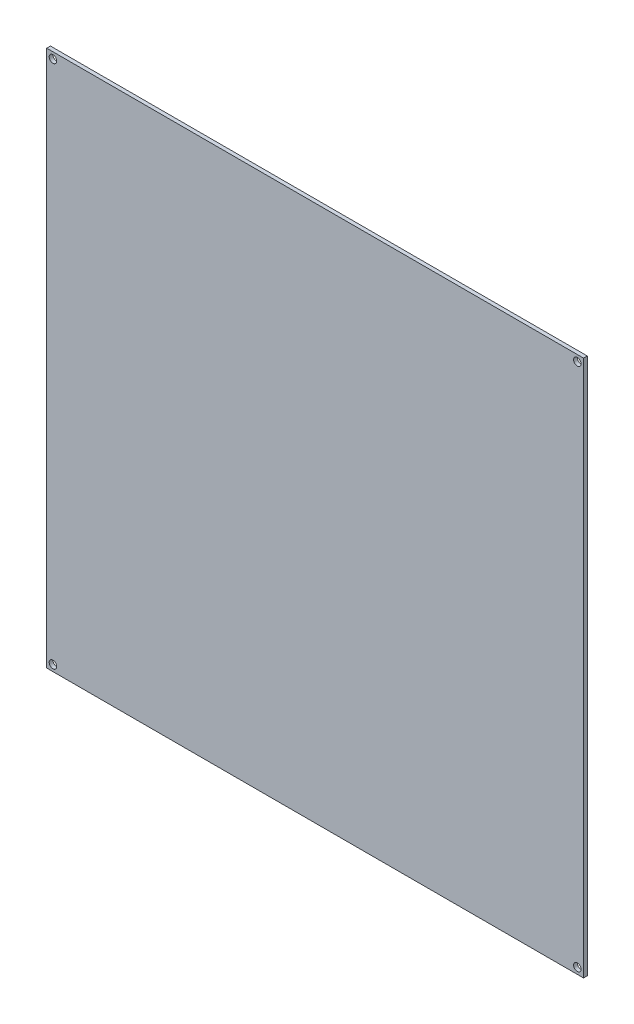
ISO-10303-21;
HEADER;
FILE_DESCRIPTION(('STEP AP214'),'2;1');
FILE_NAME('part.step','',(''),(''),'','','');
FILE_SCHEMA(('AUTOMOTIVE_DESIGN { 1 0 10303 214 1 1 1 1 }'));
ENDSEC;
DATA;
#1=APPLICATION_CONTEXT('core data for automotive mechanical design processes');
#2=APPLICATION_PROTOCOL_DEFINITION('international standard','automotive_design',2000,#1);
#3=PRODUCT_CONTEXT('',#1,'mechanical');
#4=PRODUCT('Part','Part','',(#3));
#5=PRODUCT_RELATED_PRODUCT_CATEGORY('part','',(#4));
#6=PRODUCT_DEFINITION_FORMATION('','',#4);
#7=PRODUCT_DEFINITION_CONTEXT('part definition',#1,'design');
#8=PRODUCT_DEFINITION('design','',#6,#7);
#9=PRODUCT_DEFINITION_SHAPE('','',#8);
#10=(LENGTH_UNIT() NAMED_UNIT(*) SI_UNIT(.MILLI.,.METRE.));
#11=(NAMED_UNIT(*) PLANE_ANGLE_UNIT() SI_UNIT($,.RADIAN.));
#12=(NAMED_UNIT(*) SI_UNIT($,.STERADIAN.) SOLID_ANGLE_UNIT());
#13=UNCERTAINTY_MEASURE_WITH_UNIT(LENGTH_MEASURE(1.E-05),#10,'distance_accuracy_value','');
#14=(GEOMETRIC_REPRESENTATION_CONTEXT(3) GLOBAL_UNCERTAINTY_ASSIGNED_CONTEXT((#13)) GLOBAL_UNIT_ASSIGNED_CONTEXT((#10,
#11,#12)) REPRESENTATION_CONTEXT('',''));
#15=CARTESIAN_POINT('',(0.,0.,0.));
#16=DIRECTION('',(0.,0.,1.));
#17=DIRECTION('',(1.,0.,0.));
#18=AXIS2_PLACEMENT_3D('',#15,#16,#17);
#19=CARTESIAN_POINT('',(0.,0.,1.5));
#20=DIRECTION('',(0.,0.,1.));
#21=DIRECTION('',(1.,0.,0.));
#22=AXIS2_PLACEMENT_3D('',#19,#20,#21);
#23=PLANE('',#22);
#24=CARTESIAN_POINT('',(105.,-105.,1.5));
#25=DIRECTION('',(0.,0.,1.));
#26=DIRECTION('',(1.,0.,0.));
#27=AXIS2_PLACEMENT_3D('',#24,#25,#26);
#28=CIRCLE('',#27,1.5);
#29=CARTESIAN_POINT('',(106.5,-105.,1.5));
#30=VERTEX_POINT('',#29);
#31=EDGE_CURVE('E121',#30,#30,#28,.T.);
#32=ORIENTED_EDGE('',*,*,#31,.F.);
#33=EDGE_LOOP('',(#32));
#34=FACE_BOUND('',#33,.T.);
#35=CARTESIAN_POINT('',(-105.,105.,1.5));
#36=DIRECTION('',(0.,0.,1.));
#37=DIRECTION('',(1.,0.,0.));
#38=AXIS2_PLACEMENT_3D('',#35,#36,#37);
#39=CIRCLE('',#38,1.5);
#40=CARTESIAN_POINT('',(-103.5,105.,1.5));
#41=VERTEX_POINT('',#40);
#42=EDGE_CURVE('E100',#41,#41,#39,.T.);
#43=ORIENTED_EDGE('',*,*,#42,.F.);
#44=EDGE_LOOP('',(#43));
#45=FACE_BOUND('',#44,.T.);
#46=DIRECTION('',(0.,1.,0.));
#47=VECTOR('',#46,1.);
#48=CARTESIAN_POINT('',(107.5,107.5,1.5));
#49=LINE('',#48,#47);
#50=CARTESIAN_POINT('',(107.5,-107.5,1.5));
#51=VERTEX_POINT('',#50);
#52=CARTESIAN_POINT('',(107.5,107.5,1.5));
#53=VERTEX_POINT('',#52);
#54=EDGE_CURVE('E85',#51,#53,#49,.T.);
#55=ORIENTED_EDGE('',*,*,#54,.T.);
#56=DIRECTION('',(-1.,0.,0.));
#57=VECTOR('',#56,1.);
#58=CARTESIAN_POINT('',(-107.5,107.5,1.5));
#59=LINE('',#58,#57);
#60=CARTESIAN_POINT('',(-107.5,107.5,1.5));
#61=VERTEX_POINT('',#60);
#62=EDGE_CURVE('E80',#53,#61,#59,.T.);
#63=ORIENTED_EDGE('',*,*,#62,.T.);
#64=DIRECTION('',(0.,-1.,0.));
#65=VECTOR('',#64,1.);
#66=CARTESIAN_POINT('',(-107.5,107.5,1.5));
#67=LINE('',#66,#65);
#68=CARTESIAN_POINT('',(-107.5,-107.5,1.5));
#69=VERTEX_POINT('',#68);
#70=EDGE_CURVE('E83',#61,#69,#67,.T.);
#71=ORIENTED_EDGE('',*,*,#70,.T.);
#72=DIRECTION('',(1.,0.,0.));
#73=VECTOR('',#72,1.);
#74=CARTESIAN_POINT('',(-107.5,-107.5,1.5));
#75=LINE('',#74,#73);
#76=EDGE_CURVE('E50',#69,#51,#75,.T.);
#77=ORIENTED_EDGE('',*,*,#76,.T.);
#78=EDGE_LOOP('',(#55,#63,#71,#77));
#79=FACE_BOUND('',#78,.T.);
#80=CARTESIAN_POINT('',(105.,105.,1.5));
#81=DIRECTION('',(0.,0.,1.));
#82=DIRECTION('',(1.,0.,0.));
#83=AXIS2_PLACEMENT_3D('',#80,#81,#82);
#84=CIRCLE('',#83,1.5);
#85=CARTESIAN_POINT('',(106.5,105.,1.5));
#86=VERTEX_POINT('',#85);
#87=EDGE_CURVE('E115',#86,#86,#84,.T.);
#88=ORIENTED_EDGE('',*,*,#87,.F.);
#89=EDGE_LOOP('',(#88));
#90=FACE_BOUND('',#89,.T.);
#91=CARTESIAN_POINT('',(-105.,-105.,1.5));
#92=DIRECTION('',(0.,0.,1.));
#93=DIRECTION('',(1.,0.,0.));
#94=AXIS2_PLACEMENT_3D('',#91,#92,#93);
#95=CIRCLE('',#94,1.5);
#96=CARTESIAN_POINT('',(-103.5,-105.,1.5));
#97=VERTEX_POINT('',#96);
#98=EDGE_CURVE('E127',#97,#97,#95,.T.);
#99=ORIENTED_EDGE('',*,*,#98,.F.);
#100=EDGE_LOOP('',(#99));
#101=FACE_BOUND('',#100,.T.);
#102=ADVANCED_FACE('F33',(#34,#45,#79,#90,#101),#23,.T.);
#103=CARTESIAN_POINT('',(0.,0.,0.));
#104=DIRECTION('',(0.,0.,1.));
#105=DIRECTION('',(1.,0.,0.));
#106=AXIS2_PLACEMENT_3D('',#103,#104,#105);
#107=PLANE('',#106);
#108=DIRECTION('',(0.,1.,0.));
#109=VECTOR('',#108,1.);
#110=CARTESIAN_POINT('',(107.5,107.5,0.));
#111=LINE('',#110,#109);
#112=CARTESIAN_POINT('',(107.5,-107.5,0.));
#113=VERTEX_POINT('',#112);
#114=CARTESIAN_POINT('',(107.5,107.5,0.));
#115=VERTEX_POINT('',#114);
#116=EDGE_CURVE('E97',#113,#115,#111,.T.);
#117=ORIENTED_EDGE('',*,*,#116,.F.);
#118=DIRECTION('',(1.,0.,0.));
#119=VECTOR('',#118,1.);
#120=CARTESIAN_POINT('',(-107.5,-107.5,0.));
#121=LINE('',#120,#119);
#122=CARTESIAN_POINT('',(-107.5,-107.5,0.));
#123=VERTEX_POINT('',#122);
#124=EDGE_CURVE('E73',#123,#113,#121,.T.);
#125=ORIENTED_EDGE('',*,*,#124,.F.);
#126=DIRECTION('',(0.,-1.,0.));
#127=VECTOR('',#126,1.);
#128=CARTESIAN_POINT('',(-107.5,107.5,0.));
#129=LINE('',#128,#127);
#130=CARTESIAN_POINT('',(-107.5,107.5,0.));
#131=VERTEX_POINT('',#130);
#132=EDGE_CURVE('E67',#131,#123,#129,.T.);
#133=ORIENTED_EDGE('',*,*,#132,.F.);
#134=DIRECTION('',(-1.,0.,0.));
#135=VECTOR('',#134,1.);
#136=CARTESIAN_POINT('',(-107.5,107.5,0.));
#137=LINE('',#136,#135);
#138=EDGE_CURVE('E89',#115,#131,#137,.T.);
#139=ORIENTED_EDGE('',*,*,#138,.F.);
#140=EDGE_LOOP('',(#117,#125,#133,#139));
#141=FACE_BOUND('',#140,.T.);
#142=CARTESIAN_POINT('',(-105.,105.,0.));
#143=DIRECTION('',(0.,0.,1.));
#144=DIRECTION('',(1.,0.,0.));
#145=AXIS2_PLACEMENT_3D('',#142,#143,#144);
#146=CIRCLE('',#145,1.5);
#147=CARTESIAN_POINT('',(-103.5,105.,0.));
#148=VERTEX_POINT('',#147);
#149=EDGE_CURVE('E112',#148,#148,#146,.T.);
#150=ORIENTED_EDGE('',*,*,#149,.T.);
#151=EDGE_LOOP('',(#150));
#152=FACE_BOUND('',#151,.T.);
#153=CARTESIAN_POINT('',(105.,105.,0.));
#154=DIRECTION('',(0.,0.,1.));
#155=DIRECTION('',(1.,0.,0.));
#156=AXIS2_PLACEMENT_3D('',#153,#154,#155);
#157=CIRCLE('',#156,1.5);
#158=CARTESIAN_POINT('',(106.5,105.,0.));
#159=VERTEX_POINT('',#158);
#160=EDGE_CURVE('E118',#159,#159,#157,.T.);
#161=ORIENTED_EDGE('',*,*,#160,.T.);
#162=EDGE_LOOP('',(#161));
#163=FACE_BOUND('',#162,.T.);
#164=CARTESIAN_POINT('',(105.,-105.,0.));
#165=DIRECTION('',(0.,0.,1.));
#166=DIRECTION('',(1.,0.,0.));
#167=AXIS2_PLACEMENT_3D('',#164,#165,#166);
#168=CIRCLE('',#167,1.5);
#169=CARTESIAN_POINT('',(106.5,-105.,0.));
#170=VERTEX_POINT('',#169);
#171=EDGE_CURVE('E124',#170,#170,#168,.T.);
#172=ORIENTED_EDGE('',*,*,#171,.T.);
#173=EDGE_LOOP('',(#172));
#174=FACE_BOUND('',#173,.T.);
#175=CARTESIAN_POINT('',(-105.,-105.,0.));
#176=DIRECTION('',(0.,0.,1.));
#177=DIRECTION('',(1.,0.,0.));
#178=AXIS2_PLACEMENT_3D('',#175,#176,#177);
#179=CIRCLE('',#178,1.5);
#180=CARTESIAN_POINT('',(-103.5,-105.,0.));
#181=VERTEX_POINT('',#180);
#182=EDGE_CURVE('E130',#181,#181,#179,.T.);
#183=ORIENTED_EDGE('',*,*,#182,.T.);
#184=EDGE_LOOP('',(#183));
#185=FACE_BOUND('',#184,.T.);
#186=ADVANCED_FACE('F108',(#141,#152,#163,#174,#185),#107,.F.);
#187=CARTESIAN_POINT('',(107.5,107.5,1.5));
#188=DIRECTION('',(-1.,0.,0.));
#189=DIRECTION('',(0.,-1.,0.));
#190=AXIS2_PLACEMENT_3D('',#187,#188,#189);
#191=PLANE('',#190);
#192=ORIENTED_EDGE('',*,*,#116,.T.);
#193=DIRECTION('',(0.,0.,-1.));
#194=VECTOR('',#193,1.);
#195=CARTESIAN_POINT('',(107.5,107.5,1.5));
#196=LINE('',#195,#194);
#197=EDGE_CURVE('E11',#53,#115,#196,.T.);
#198=ORIENTED_EDGE('',*,*,#197,.F.);
#199=ORIENTED_EDGE('',*,*,#54,.F.);
#200=DIRECTION('',(0.,0.,-1.));
#201=VECTOR('',#200,1.);
#202=CARTESIAN_POINT('',(107.5,-107.5,1.5));
#203=LINE('',#202,#201);
#204=EDGE_CURVE('E93',#51,#113,#203,.T.);
#205=ORIENTED_EDGE('',*,*,#204,.T.);
#206=EDGE_LOOP('',(#192,#198,#199,#205));
#207=FACE_BOUND('',#206,.T.);
#208=ADVANCED_FACE('F35',(#207),#191,.F.);
#209=CARTESIAN_POINT('',(-107.5,107.5,1.5));
#210=DIRECTION('',(0.,-1.,0.));
#211=DIRECTION('',(0.,0.,-1.));
#212=AXIS2_PLACEMENT_3D('',#209,#210,#211);
#213=PLANE('',#212);
#214=ORIENTED_EDGE('',*,*,#138,.T.);
#215=DIRECTION('',(0.,0.,-1.));
#216=VECTOR('',#215,1.);
#217=CARTESIAN_POINT('',(-107.5,107.5,1.5));
#218=LINE('',#217,#216);
#219=EDGE_CURVE('E42',#61,#131,#218,.T.);
#220=ORIENTED_EDGE('',*,*,#219,.F.);
#221=ORIENTED_EDGE('',*,*,#62,.F.);
#222=ORIENTED_EDGE('',*,*,#197,.T.);
#223=EDGE_LOOP('',(#214,#220,#221,#222));
#224=FACE_BOUND('',#223,.T.);
#225=ADVANCED_FACE('F88',(#224),#213,.F.);
#226=CARTESIAN_POINT('',(-107.5,107.5,1.5));
#227=DIRECTION('',(1.,0.,0.));
#228=DIRECTION('',(0.,1.,0.));
#229=AXIS2_PLACEMENT_3D('',#226,#227,#228);
#230=PLANE('',#229);
#231=ORIENTED_EDGE('',*,*,#132,.T.);
#232=DIRECTION('',(0.,0.,-1.));
#233=VECTOR('',#232,1.);
#234=CARTESIAN_POINT('',(-107.5,-107.5,1.5));
#235=LINE('',#234,#233);
#236=EDGE_CURVE('E90',#69,#123,#235,.T.);
#237=ORIENTED_EDGE('',*,*,#236,.F.);
#238=ORIENTED_EDGE('',*,*,#70,.F.);
#239=ORIENTED_EDGE('',*,*,#219,.T.);
#240=EDGE_LOOP('',(#231,#237,#238,#239));
#241=FACE_BOUND('',#240,.T.);
#242=ADVANCED_FACE('F91',(#241),#230,.F.);
#243=CARTESIAN_POINT('',(-107.5,-107.5,1.5));
#244=DIRECTION('',(0.,1.,0.));
#245=DIRECTION('',(0.,0.,1.));
#246=AXIS2_PLACEMENT_3D('',#243,#244,#245);
#247=PLANE('',#246);
#248=ORIENTED_EDGE('',*,*,#124,.T.);
#249=ORIENTED_EDGE('',*,*,#204,.F.);
#250=ORIENTED_EDGE('',*,*,#76,.F.);
#251=ORIENTED_EDGE('',*,*,#236,.T.);
#252=EDGE_LOOP('',(#248,#249,#250,#251));
#253=FACE_BOUND('',#252,.T.);
#254=ADVANCED_FACE('F105',(#253),#247,.F.);
#255=CARTESIAN_POINT('',(-105.,105.,1.5));
#256=DIRECTION('',(0.,0.,-1.));
#257=DIRECTION('',(-1.,0.,0.));
#258=AXIS2_PLACEMENT_3D('',#255,#256,#257);
#259=CYLINDRICAL_SURFACE('',#258,1.5);
#260=ORIENTED_EDGE('',*,*,#42,.T.);
#261=EDGE_LOOP('',(#260));
#262=FACE_BOUND('',#261,.T.);
#263=ORIENTED_EDGE('',*,*,#149,.F.);
#264=EDGE_LOOP('',(#263));
#265=FACE_BOUND('',#264,.T.);
#266=ADVANCED_FACE('F149',(#262,#265),#259,.F.);
#267=CARTESIAN_POINT('',(105.,105.,1.5));
#268=DIRECTION('',(0.,0.,-1.));
#269=DIRECTION('',(-1.,0.,0.));
#270=AXIS2_PLACEMENT_3D('',#267,#268,#269);
#271=CYLINDRICAL_SURFACE('',#270,1.5);
#272=ORIENTED_EDGE('',*,*,#87,.T.);
#273=EDGE_LOOP('',(#272));
#274=FACE_BOUND('',#273,.T.);
#275=ORIENTED_EDGE('',*,*,#160,.F.);
#276=EDGE_LOOP('',(#275));
#277=FACE_BOUND('',#276,.T.);
#278=ADVANCED_FACE('F195',(#274,#277),#271,.F.);
#279=CARTESIAN_POINT('',(105.,-105.,1.5));
#280=DIRECTION('',(0.,0.,-1.));
#281=DIRECTION('',(-1.,0.,0.));
#282=AXIS2_PLACEMENT_3D('',#279,#280,#281);
#283=CYLINDRICAL_SURFACE('',#282,1.5);
#284=ORIENTED_EDGE('',*,*,#31,.T.);
#285=EDGE_LOOP('',(#284));
#286=FACE_BOUND('',#285,.T.);
#287=ORIENTED_EDGE('',*,*,#171,.F.);
#288=EDGE_LOOP('',(#287));
#289=FACE_BOUND('',#288,.T.);
#290=ADVANCED_FACE('F203',(#286,#289),#283,.F.);
#291=CARTESIAN_POINT('',(-105.,-105.,1.5));
#292=DIRECTION('',(0.,0.,-1.));
#293=DIRECTION('',(-1.,0.,0.));
#294=AXIS2_PLACEMENT_3D('',#291,#292,#293);
#295=CYLINDRICAL_SURFACE('',#294,1.5);
#296=ORIENTED_EDGE('',*,*,#98,.T.);
#297=EDGE_LOOP('',(#296));
#298=FACE_BOUND('',#297,.T.);
#299=ORIENTED_EDGE('',*,*,#182,.F.);
#300=EDGE_LOOP('',(#299));
#301=FACE_BOUND('',#300,.T.);
#302=ADVANCED_FACE('F136',(#298,#301),#295,.F.);
#303=CLOSED_SHELL('',(#102,#186,#208,#225,#242,#254,#266,#278,#290,#302));
#304=MANIFOLD_SOLID_BREP('B2',#303);
#305=ADVANCED_BREP_SHAPE_REPRESENTATION('',(#18,#304),#14);
#306=SHAPE_DEFINITION_REPRESENTATION(#9,#305);
ENDSEC;
END-ISO-10303-21;
